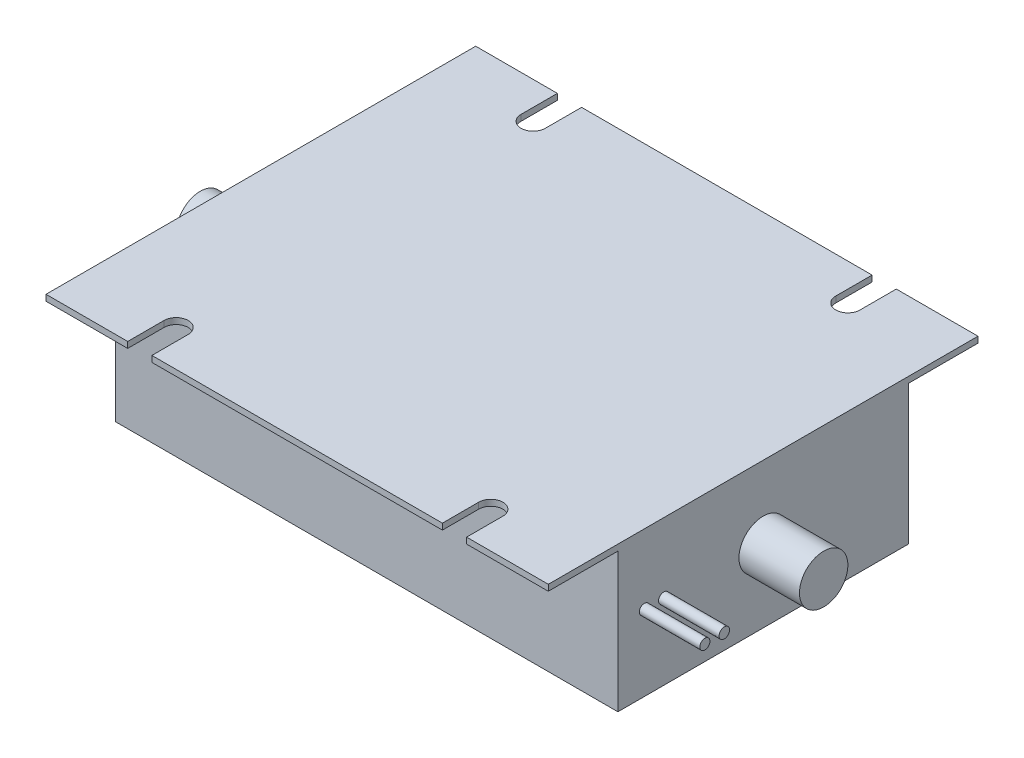
ISO-10303-21;
HEADER;
FILE_DESCRIPTION(('STEP AP214'),'2;1');
FILE_NAME('part.step','',(''),(''),'','','');
FILE_SCHEMA(('AUTOMOTIVE_DESIGN { 1 0 10303 214 1 1 1 1 }'));
ENDSEC;
DATA;
#1=APPLICATION_CONTEXT('core data for automotive mechanical design processes');
#2=APPLICATION_PROTOCOL_DEFINITION('international standard','automotive_design',2000,#1);
#3=PRODUCT_CONTEXT('',#1,'mechanical');
#4=PRODUCT('Part','Part','',(#3));
#5=PRODUCT_RELATED_PRODUCT_CATEGORY('part','',(#4));
#6=PRODUCT_DEFINITION_FORMATION('','',#4);
#7=PRODUCT_DEFINITION_CONTEXT('part definition',#1,'design');
#8=PRODUCT_DEFINITION('design','',#6,#7);
#9=PRODUCT_DEFINITION_SHAPE('','',#8);
#10=(LENGTH_UNIT() NAMED_UNIT(*) SI_UNIT(.MILLI.,.METRE.));
#11=(NAMED_UNIT(*) PLANE_ANGLE_UNIT() SI_UNIT($,.RADIAN.));
#12=(NAMED_UNIT(*) SI_UNIT($,.STERADIAN.) SOLID_ANGLE_UNIT());
#13=UNCERTAINTY_MEASURE_WITH_UNIT(LENGTH_MEASURE(1.E-05),#10,'distance_accuracy_value','');
#14=(GEOMETRIC_REPRESENTATION_CONTEXT(3) GLOBAL_UNCERTAINTY_ASSIGNED_CONTEXT((#13)) GLOBAL_UNIT_ASSIGNED_CONTEXT((#10,
#11,#12)) REPRESENTATION_CONTEXT('',''));
#15=CARTESIAN_POINT('',(0.,0.,0.));
#16=DIRECTION('',(0.,0.,1.));
#17=DIRECTION('',(1.,0.,0.));
#18=AXIS2_PLACEMENT_3D('',#15,#16,#17);
#19=CARTESIAN_POINT('',(0.,0.,35.5));
#20=DIRECTION('',(0.,0.,1.));
#21=DIRECTION('',(1.,0.,0.));
#22=AXIS2_PLACEMENT_3D('',#19,#20,#21);
#23=PLANE('',#22);
#24=DIRECTION('',(-1.,0.,0.));
#25=VECTOR('',#24,1.);
#26=CARTESIAN_POINT('',(-41.5,17.,35.5));
#27=LINE('',#26,#25);
#28=CARTESIAN_POINT('',(24.,17.,35.5));
#29=VERTEX_POINT('',#28);
#30=CARTESIAN_POINT('',(-24.,17.,35.5));
#31=VERTEX_POINT('',#30);
#32=EDGE_CURVE('E304',#29,#31,#27,.T.);
#33=ORIENTED_EDGE('',*,*,#32,.F.);
#34=DIRECTION('',(0.,1.,0.));
#35=VECTOR('',#34,1.);
#36=CARTESIAN_POINT('',(24.,0.,35.5));
#37=LINE('',#36,#35);
#38=CARTESIAN_POINT('',(24.,18.,35.5));
#39=VERTEX_POINT('',#38);
#40=EDGE_CURVE('E373',#29,#39,#37,.T.);
#41=ORIENTED_EDGE('',*,*,#40,.T.);
#42=DIRECTION('',(1.,0.,0.));
#43=VECTOR('',#42,1.);
#44=CARTESIAN_POINT('',(41.5,18.,35.5));
#45=LINE('',#44,#43);
#46=CARTESIAN_POINT('',(-24.,18.,35.5));
#47=VERTEX_POINT('',#46);
#48=EDGE_CURVE('E215',#47,#39,#45,.T.);
#49=ORIENTED_EDGE('',*,*,#48,.F.);
#50=DIRECTION('',(0.,1.,0.));
#51=VECTOR('',#50,1.);
#52=CARTESIAN_POINT('',(-24.,0.,35.5));
#53=LINE('',#52,#51);
#54=EDGE_CURVE('E368',#31,#47,#53,.T.);
#55=ORIENTED_EDGE('',*,*,#54,.F.);
#56=EDGE_LOOP('',(#33,#41,#49,#55));
#57=FACE_BOUND('',#56,.T.);
#58=ADVANCED_FACE('F33',(#57),#23,.T.);
#59=CARTESIAN_POINT('',(-28.,17.,35.5));
#60=VERTEX_POINT('',#59);
#61=CARTESIAN_POINT('',(-41.5,17.,35.5));
#62=VERTEX_POINT('',#61);
#63=EDGE_CURVE('E299',#60,#62,#27,.T.);
#64=ORIENTED_EDGE('',*,*,#63,.F.);
#65=DIRECTION('',(0.,1.,0.));
#66=VECTOR('',#65,1.);
#67=CARTESIAN_POINT('',(-28.,0.,35.5));
#68=LINE('',#67,#66);
#69=CARTESIAN_POINT('',(-28.,18.,35.5));
#70=VERTEX_POINT('',#69);
#71=EDGE_CURVE('E366',#60,#70,#68,.T.);
#72=ORIENTED_EDGE('',*,*,#71,.T.);
#73=CARTESIAN_POINT('',(-41.5,18.,35.5));
#74=VERTEX_POINT('',#73);
#75=EDGE_CURVE('E283',#74,#70,#45,.T.);
#76=ORIENTED_EDGE('',*,*,#75,.F.);
#77=DIRECTION('',(0.,1.,0.));
#78=VECTOR('',#77,1.);
#79=CARTESIAN_POINT('',(-41.5,18.,35.5));
#80=LINE('',#79,#78);
#81=EDGE_CURVE('E303',#62,#74,#80,.T.);
#82=ORIENTED_EDGE('',*,*,#81,.F.);
#83=EDGE_LOOP('',(#64,#72,#76,#82));
#84=FACE_BOUND('',#83,.T.);
#85=ADVANCED_FACE('F448',(#84),#23,.T.);
#86=CARTESIAN_POINT('',(0.,0.,-35.5));
#87=DIRECTION('',(0.,0.,1.));
#88=DIRECTION('',(1.,0.,0.));
#89=AXIS2_PLACEMENT_3D('',#86,#87,#88);
#90=PLANE('',#89);
#91=DIRECTION('',(0.,1.,0.));
#92=VECTOR('',#91,1.);
#93=CARTESIAN_POINT('',(-24.,-6.,-35.5));
#94=LINE('',#93,#92);
#95=CARTESIAN_POINT('',(-24.,17.,-35.5));
#96=VERTEX_POINT('',#95);
#97=CARTESIAN_POINT('',(-24.,18.,-35.5));
#98=VERTEX_POINT('',#97);
#99=EDGE_CURVE('E256',#96,#98,#94,.T.);
#100=ORIENTED_EDGE('',*,*,#99,.T.);
#101=DIRECTION('',(1.,0.,0.));
#102=VECTOR('',#101,1.);
#103=CARTESIAN_POINT('',(41.5,18.,-35.5));
#104=LINE('',#103,#102);
#105=CARTESIAN_POINT('',(24.,18.,-35.5));
#106=VERTEX_POINT('',#105);
#107=EDGE_CURVE('E296',#98,#106,#104,.T.);
#108=ORIENTED_EDGE('',*,*,#107,.T.);
#109=DIRECTION('',(0.,1.,0.));
#110=VECTOR('',#109,1.);
#111=CARTESIAN_POINT('',(24.,-6.,-35.5));
#112=LINE('',#111,#110);
#113=CARTESIAN_POINT('',(24.,17.,-35.5));
#114=VERTEX_POINT('',#113);
#115=EDGE_CURVE('E272',#114,#106,#112,.T.);
#116=ORIENTED_EDGE('',*,*,#115,.F.);
#117=DIRECTION('',(-1.,0.,0.));
#118=VECTOR('',#117,1.);
#119=CARTESIAN_POINT('',(-41.5,17.,-35.5));
#120=LINE('',#119,#118);
#121=EDGE_CURVE('E288',#114,#96,#120,.T.);
#122=ORIENTED_EDGE('',*,*,#121,.T.);
#123=EDGE_LOOP('',(#100,#108,#116,#122));
#124=FACE_BOUND('',#123,.T.);
#125=ADVANCED_FACE('F398',(#124),#90,.F.);
#126=DIRECTION('',(0.,1.,0.));
#127=VECTOR('',#126,1.);
#128=CARTESIAN_POINT('',(28.,-6.,-35.5));
#129=LINE('',#128,#127);
#130=CARTESIAN_POINT('',(28.,17.,-35.5));
#131=VERTEX_POINT('',#130);
#132=CARTESIAN_POINT('',(28.,18.,-35.5));
#133=VERTEX_POINT('',#132);
#134=EDGE_CURVE('E275',#131,#133,#129,.T.);
#135=ORIENTED_EDGE('',*,*,#134,.T.);
#136=CARTESIAN_POINT('',(41.5,18.,-35.5));
#137=VERTEX_POINT('',#136);
#138=EDGE_CURVE('E291',#133,#137,#104,.T.);
#139=ORIENTED_EDGE('',*,*,#138,.T.);
#140=DIRECTION('',(0.,-1.,0.));
#141=VECTOR('',#140,1.);
#142=CARTESIAN_POINT('',(41.5,17.,-35.5));
#143=LINE('',#142,#141);
#144=CARTESIAN_POINT('',(41.5,17.,-35.5));
#145=VERTEX_POINT('',#144);
#146=EDGE_CURVE('E279',#137,#145,#143,.T.);
#147=ORIENTED_EDGE('',*,*,#146,.T.);
#148=EDGE_CURVE('E284',#145,#131,#120,.T.);
#149=ORIENTED_EDGE('',*,*,#148,.T.);
#150=EDGE_LOOP('',(#135,#139,#147,#149));
#151=FACE_BOUND('',#150,.T.);
#152=ADVANCED_FACE('F543',(#151),#90,.F.);
#153=CARTESIAN_POINT('',(-41.5,-6.,24.));
#154=DIRECTION('',(0.,0.,1.));
#155=DIRECTION('',(1.,0.,0.));
#156=AXIS2_PLACEMENT_3D('',#153,#154,#155);
#157=PLANE('',#156);
#158=DIRECTION('',(0.,1.,0.));
#159=VECTOR('',#158,1.);
#160=CARTESIAN_POINT('',(41.5,-6.,24.));
#161=LINE('',#160,#159);
#162=CARTESIAN_POINT('',(41.5,-6.,24.));
#163=VERTEX_POINT('',#162);
#164=CARTESIAN_POINT('',(41.5,17.,24.));
#165=VERTEX_POINT('',#164);
#166=EDGE_CURVE('E336',#163,#165,#161,.T.);
#167=ORIENTED_EDGE('',*,*,#166,.T.);
#168=DIRECTION('',(-1.,0.,0.));
#169=VECTOR('',#168,1.);
#170=CARTESIAN_POINT('',(-41.5,17.,24.));
#171=LINE('',#170,#169);
#172=CARTESIAN_POINT('',(-41.5,17.,24.));
#173=VERTEX_POINT('',#172);
#174=EDGE_CURVE('E319',#165,#173,#171,.T.);
#175=ORIENTED_EDGE('',*,*,#174,.T.);
#176=DIRECTION('',(0.,1.,0.));
#177=VECTOR('',#176,1.);
#178=CARTESIAN_POINT('',(-41.5,-6.,24.));
#179=LINE('',#178,#177);
#180=CARTESIAN_POINT('',(-41.5,-6.,24.));
#181=VERTEX_POINT('',#180);
#182=EDGE_CURVE('E340',#181,#173,#179,.T.);
#183=ORIENTED_EDGE('',*,*,#182,.F.);
#184=DIRECTION('',(1.,0.,0.));
#185=VECTOR('',#184,1.);
#186=CARTESIAN_POINT('',(-41.5,-6.,24.));
#187=LINE('',#186,#185);
#188=EDGE_CURVE('E323',#181,#163,#187,.T.);
#189=ORIENTED_EDGE('',*,*,#188,.T.);
#190=EDGE_LOOP('',(#167,#175,#183,#189));
#191=FACE_BOUND('',#190,.T.);
#192=ADVANCED_FACE('F35',(#191),#157,.T.);
#193=CARTESIAN_POINT('',(41.5,-6.,-24.));
#194=DIRECTION('',(0.,0.,-1.));
#195=DIRECTION('',(-1.,0.,0.));
#196=AXIS2_PLACEMENT_3D('',#193,#194,#195);
#197=PLANE('',#196);
#198=DIRECTION('',(0.,1.,0.));
#199=VECTOR('',#198,1.);
#200=CARTESIAN_POINT('',(-41.5,-6.,-24.));
#201=LINE('',#200,#199);
#202=CARTESIAN_POINT('',(-41.5,-6.,-24.));
#203=VERTEX_POINT('',#202);
#204=CARTESIAN_POINT('',(-41.5,17.,-24.));
#205=VERTEX_POINT('',#204);
#206=EDGE_CURVE('E344',#203,#205,#201,.T.);
#207=ORIENTED_EDGE('',*,*,#206,.T.);
#208=DIRECTION('',(1.,0.,0.));
#209=VECTOR('',#208,1.);
#210=CARTESIAN_POINT('',(41.5,17.,-24.));
#211=LINE('',#210,#209);
#212=CARTESIAN_POINT('',(41.5,17.,-24.));
#213=VERTEX_POINT('',#212);
#214=EDGE_CURVE('E316',#205,#213,#211,.T.);
#215=ORIENTED_EDGE('',*,*,#214,.T.);
#216=DIRECTION('',(0.,1.,0.));
#217=VECTOR('',#216,1.);
#218=CARTESIAN_POINT('',(41.5,-6.,-24.));
#219=LINE('',#218,#217);
#220=CARTESIAN_POINT('',(41.5,-6.,-24.));
#221=VERTEX_POINT('',#220);
#222=EDGE_CURVE('E347',#221,#213,#219,.T.);
#223=ORIENTED_EDGE('',*,*,#222,.F.);
#224=DIRECTION('',(-1.,0.,0.));
#225=VECTOR('',#224,1.);
#226=CARTESIAN_POINT('',(41.5,-6.,-24.));
#227=LINE('',#226,#225);
#228=EDGE_CURVE('E330',#221,#203,#227,.T.);
#229=ORIENTED_EDGE('',*,*,#228,.T.);
#230=EDGE_LOOP('',(#207,#215,#223,#229));
#231=FACE_BOUND('',#230,.T.);
#232=ADVANCED_FACE('F476',(#231),#197,.T.);
#233=CARTESIAN_POINT('',(-41.5,-6.,-24.));
#234=DIRECTION('',(-1.,0.,0.));
#235=DIRECTION('',(0.,0.,1.));
#236=AXIS2_PLACEMENT_3D('',#233,#234,#235);
#237=PLANE('',#236);
#238=CARTESIAN_POINT('',(-41.5,6.,0.));
#239=DIRECTION('',(-1.,0.,0.));
#240=DIRECTION('',(0.,0.,1.));
#241=AXIS2_PLACEMENT_3D('',#238,#239,#240);
#242=CIRCLE('',#241,4.);
#243=CARTESIAN_POINT('',(-41.5,6.,4.00000000000001));
#244=VERTEX_POINT('',#243);
#245=EDGE_CURVE('E716',#244,#244,#242,.T.);
#246=ORIENTED_EDGE('',*,*,#245,.F.);
#247=EDGE_LOOP('',(#246));
#248=FACE_BOUND('',#247,.T.);
#249=DIRECTION('',(0.,0.,1.));
#250=VECTOR('',#249,1.);
#251=CARTESIAN_POINT('',(-41.5,17.,-35.5));
#252=LINE('',#251,#250);
#253=CARTESIAN_POINT('',(-41.5,17.,-35.5));
#254=VERTEX_POINT('',#253);
#255=EDGE_CURVE('E310',#254,#205,#252,.T.);
#256=ORIENTED_EDGE('',*,*,#255,.T.);
#257=ORIENTED_EDGE('',*,*,#206,.F.);
#258=DIRECTION('',(0.,0.,1.));
#259=VECTOR('',#258,1.);
#260=CARTESIAN_POINT('',(-41.5,-6.,-24.));
#261=LINE('',#260,#259);
#262=EDGE_CURVE('E333',#203,#181,#261,.T.);
#263=ORIENTED_EDGE('',*,*,#262,.T.);
#264=ORIENTED_EDGE('',*,*,#182,.T.);
#265=EDGE_CURVE('E295',#173,#62,#252,.T.);
#266=ORIENTED_EDGE('',*,*,#265,.T.);
#267=ORIENTED_EDGE('',*,*,#81,.T.);
#268=DIRECTION('',(0.,0.,1.));
#269=VECTOR('',#268,1.);
#270=CARTESIAN_POINT('',(-41.5,18.,-24.));
#271=LINE('',#270,#269);
#272=CARTESIAN_POINT('',(-41.5,18.,-35.5));
#273=VERTEX_POINT('',#272);
#274=EDGE_CURVE('E327',#273,#74,#271,.T.);
#275=ORIENTED_EDGE('',*,*,#274,.F.);
#276=DIRECTION('',(0.,1.,0.));
#277=VECTOR('',#276,1.);
#278=CARTESIAN_POINT('',(-41.5,18.,-35.5));
#279=LINE('',#278,#277);
#280=EDGE_CURVE('E287',#254,#273,#279,.T.);
#281=ORIENTED_EDGE('',*,*,#280,.F.);
#282=EDGE_LOOP('',(#256,#257,#263,#264,#266,#267,#275,#281));
#283=FACE_BOUND('',#282,.T.);
#284=ADVANCED_FACE('F421',(#248,#283),#237,.T.);
#285=CARTESIAN_POINT('',(41.5,-6.,24.));
#286=DIRECTION('',(1.,0.,0.));
#287=DIRECTION('',(0.,0.,-1.));
#288=AXIS2_PLACEMENT_3D('',#285,#286,#287);
#289=PLANE('',#288);
#290=CARTESIAN_POINT('',(41.5,6.49948181283472,16.419283225137));
#291=DIRECTION('',(1.,0.,0.));
#292=DIRECTION('',(0.,0.,-1.));
#293=AXIS2_PLACEMENT_3D('',#290,#291,#292);
#294=CIRCLE('',#293,0.866649433394376);
#295=CARTESIAN_POINT('',(41.5,6.49948181283472,15.5526337917427));
#296=VERTEX_POINT('',#295);
#297=EDGE_CURVE('E489',#296,#296,#294,.T.);
#298=ORIENTED_EDGE('',*,*,#297,.F.);
#299=EDGE_LOOP('',(#298));
#300=FACE_BOUND('',#299,.T.);
#301=CARTESIAN_POINT('',(41.5,6.49948181283472,19.6285527423375));
#302=DIRECTION('',(1.,0.,0.));
#303=DIRECTION('',(0.,0.,-1.));
#304=AXIS2_PLACEMENT_3D('',#301,#302,#303);
#305=CIRCLE('',#304,0.835314328900505);
#306=CARTESIAN_POINT('',(41.5,6.49948181283472,18.793238413437));
#307=VERTEX_POINT('',#306);
#308=EDGE_CURVE('E493',#307,#307,#305,.T.);
#309=ORIENTED_EDGE('',*,*,#308,.F.);
#310=EDGE_LOOP('',(#309));
#311=FACE_BOUND('',#310,.T.);
#312=CARTESIAN_POINT('',(41.5,6.,0.));
#313=DIRECTION('',(1.,0.,0.));
#314=DIRECTION('',(0.,0.,-1.));
#315=AXIS2_PLACEMENT_3D('',#312,#313,#314);
#316=CIRCLE('',#315,4.);
#317=CARTESIAN_POINT('',(41.5,6.,-3.99999999999999));
#318=VERTEX_POINT('',#317);
#319=EDGE_CURVE('E11',#318,#318,#316,.T.);
#320=ORIENTED_EDGE('',*,*,#319,.F.);
#321=EDGE_LOOP('',(#320));
#322=FACE_BOUND('',#321,.T.);
#323=DIRECTION('',(0.,0.,-1.));
#324=VECTOR('',#323,1.);
#325=CARTESIAN_POINT('',(41.5,18.,24.));
#326=LINE('',#325,#324);
#327=CARTESIAN_POINT('',(41.5,18.,35.5));
#328=VERTEX_POINT('',#327);
#329=EDGE_CURVE('E322',#328,#137,#326,.T.);
#330=ORIENTED_EDGE('',*,*,#329,.F.);
#331=DIRECTION('',(0.,-1.,0.));
#332=VECTOR('',#331,1.);
#333=CARTESIAN_POINT('',(41.5,17.,35.5));
#334=LINE('',#333,#332);
#335=CARTESIAN_POINT('',(41.5,17.,35.5));
#336=VERTEX_POINT('',#335);
#337=EDGE_CURVE('E271',#328,#336,#334,.T.);
#338=ORIENTED_EDGE('',*,*,#337,.T.);
#339=DIRECTION('',(0.,0.,1.));
#340=VECTOR('',#339,1.);
#341=CARTESIAN_POINT('',(41.5,17.,-35.5));
#342=LINE('',#341,#340);
#343=EDGE_CURVE('E313',#165,#336,#342,.T.);
#344=ORIENTED_EDGE('',*,*,#343,.F.);
#345=ORIENTED_EDGE('',*,*,#166,.F.);
#346=DIRECTION('',(0.,0.,-1.));
#347=VECTOR('',#346,1.);
#348=CARTESIAN_POINT('',(41.5,-6.,24.));
#349=LINE('',#348,#347);
#350=EDGE_CURVE('E326',#163,#221,#349,.T.);
#351=ORIENTED_EDGE('',*,*,#350,.T.);
#352=ORIENTED_EDGE('',*,*,#222,.T.);
#353=EDGE_CURVE('E314',#145,#213,#342,.T.);
#354=ORIENTED_EDGE('',*,*,#353,.F.);
#355=ORIENTED_EDGE('',*,*,#146,.F.);
#356=EDGE_LOOP('',(#330,#338,#344,#345,#351,#352,#354,#355));
#357=FACE_BOUND('',#356,.T.);
#358=ADVANCED_FACE('F389',(#300,#311,#322,#357),#289,.T.);
#359=CARTESIAN_POINT('',(0.,-6.,0.));
#360=DIRECTION('',(0.,1.,0.));
#361=DIRECTION('',(0.,0.,1.));
#362=AXIS2_PLACEMENT_3D('',#359,#360,#361);
#363=PLANE('',#362);
#364=ORIENTED_EDGE('',*,*,#188,.F.);
#365=ORIENTED_EDGE('',*,*,#262,.F.);
#366=ORIENTED_EDGE('',*,*,#228,.F.);
#367=ORIENTED_EDGE('',*,*,#350,.F.);
#368=EDGE_LOOP('',(#364,#365,#366,#367));
#369=FACE_BOUND('',#368,.T.);
#370=ADVANCED_FACE('F468',(#369),#363,.F.);
#371=CARTESIAN_POINT('',(0.,18.,0.));
#372=DIRECTION('',(0.,1.,0.));
#373=DIRECTION('',(0.,0.,1.));
#374=AXIS2_PLACEMENT_3D('',#371,#372,#373);
#375=PLANE('',#374);
#376=DIRECTION('',(0.,0.,-1.));
#377=VECTOR('',#376,1.);
#378=CARTESIAN_POINT('',(28.,18.,0.));
#379=LINE('',#378,#377);
#380=CARTESIAN_POINT('',(28.,18.,35.5));
#381=VERTEX_POINT('',#380);
#382=CARTESIAN_POINT('',(28.,18.,29.5));
#383=VERTEX_POINT('',#382);
#384=EDGE_CURVE('E200',#381,#383,#379,.T.);
#385=ORIENTED_EDGE('',*,*,#384,.F.);
#386=EDGE_CURVE('E307',#381,#328,#45,.T.);
#387=ORIENTED_EDGE('',*,*,#386,.T.);
#388=ORIENTED_EDGE('',*,*,#329,.T.);
#389=ORIENTED_EDGE('',*,*,#138,.F.);
#390=DIRECTION('',(0.,0.,1.));
#391=VECTOR('',#390,1.);
#392=CARTESIAN_POINT('',(28.,18.,0.));
#393=LINE('',#392,#391);
#394=CARTESIAN_POINT('',(28.,18.,-29.5));
#395=VERTEX_POINT('',#394);
#396=EDGE_CURVE('E262',#133,#395,#393,.T.);
#397=ORIENTED_EDGE('',*,*,#396,.T.);
#398=CARTESIAN_POINT('',(26.,18.,-29.5));
#399=DIRECTION('',(0.,1.,0.));
#400=DIRECTION('',(0.,0.,1.));
#401=AXIS2_PLACEMENT_3D('',#398,#399,#400);
#402=CIRCLE('',#401,2.);
#403=CARTESIAN_POINT('',(24.,18.,-29.5));
#404=VERTEX_POINT('',#403);
#405=EDGE_CURVE('E253',#404,#395,#402,.T.);
#406=ORIENTED_EDGE('',*,*,#405,.F.);
#407=DIRECTION('',(0.,0.,1.));
#408=VECTOR('',#407,1.);
#409=CARTESIAN_POINT('',(24.,18.,0.));
#410=LINE('',#409,#408);
#411=EDGE_CURVE('E265',#106,#404,#410,.T.);
#412=ORIENTED_EDGE('',*,*,#411,.F.);
#413=ORIENTED_EDGE('',*,*,#107,.F.);
#414=DIRECTION('',(0.,0.,1.));
#415=VECTOR('',#414,1.);
#416=CARTESIAN_POINT('',(-24.,18.,0.));
#417=LINE('',#416,#415);
#418=CARTESIAN_POINT('',(-24.,18.,-29.5));
#419=VERTEX_POINT('',#418);
#420=EDGE_CURVE('E244',#98,#419,#417,.T.);
#421=ORIENTED_EDGE('',*,*,#420,.T.);
#422=CARTESIAN_POINT('',(-26.,18.,-29.5));
#423=DIRECTION('',(0.,-1.,0.));
#424=DIRECTION('',(0.,0.,1.));
#425=AXIS2_PLACEMENT_3D('',#422,#423,#424);
#426=CIRCLE('',#425,2.);
#427=CARTESIAN_POINT('',(-28.,18.,-29.5));
#428=VERTEX_POINT('',#427);
#429=EDGE_CURVE('E241',#419,#428,#426,.T.);
#430=ORIENTED_EDGE('',*,*,#429,.T.);
#431=DIRECTION('',(0.,0.,1.));
#432=VECTOR('',#431,1.);
#433=CARTESIAN_POINT('',(-28.,18.,0.));
#434=LINE('',#433,#432);
#435=CARTESIAN_POINT('',(-28.,18.,-35.5));
#436=VERTEX_POINT('',#435);
#437=EDGE_CURVE('E247',#436,#428,#434,.T.);
#438=ORIENTED_EDGE('',*,*,#437,.F.);
#439=EDGE_CURVE('E292',#273,#436,#104,.T.);
#440=ORIENTED_EDGE('',*,*,#439,.F.);
#441=ORIENTED_EDGE('',*,*,#274,.T.);
#442=ORIENTED_EDGE('',*,*,#75,.T.);
#443=DIRECTION('',(0.,0.,-1.));
#444=VECTOR('',#443,1.);
#445=CARTESIAN_POINT('',(-28.,18.,0.));
#446=LINE('',#445,#444);
#447=CARTESIAN_POINT('',(-28.,18.,29.5));
#448=VERTEX_POINT('',#447);
#449=EDGE_CURVE('E56',#70,#448,#446,.T.);
#450=ORIENTED_EDGE('',*,*,#449,.T.);
#451=CARTESIAN_POINT('',(-26.,18.,29.5));
#452=DIRECTION('',(0.,1.,0.));
#453=DIRECTION('',(0.,0.,-1.));
#454=AXIS2_PLACEMENT_3D('',#451,#452,#453);
#455=CIRCLE('',#454,2.);
#456=CARTESIAN_POINT('',(-24.,18.,29.5));
#457=VERTEX_POINT('',#456);
#458=EDGE_CURVE('E225',#457,#448,#455,.T.);
#459=ORIENTED_EDGE('',*,*,#458,.F.);
#460=DIRECTION('',(0.,0.,-1.));
#461=VECTOR('',#460,1.);
#462=CARTESIAN_POINT('',(-24.,18.,0.));
#463=LINE('',#462,#461);
#464=EDGE_CURVE('E229',#47,#457,#463,.T.);
#465=ORIENTED_EDGE('',*,*,#464,.F.);
#466=ORIENTED_EDGE('',*,*,#48,.T.);
#467=DIRECTION('',(0.,0.,-1.));
#468=VECTOR('',#467,1.);
#469=CARTESIAN_POINT('',(24.,18.,0.));
#470=LINE('',#469,#468);
#471=CARTESIAN_POINT('',(24.,18.,29.5));
#472=VERTEX_POINT('',#471);
#473=EDGE_CURVE('E48',#39,#472,#470,.T.);
#474=ORIENTED_EDGE('',*,*,#473,.T.);
#475=CARTESIAN_POINT('',(26.,18.,29.5));
#476=DIRECTION('',(0.,-1.,0.));
#477=DIRECTION('',(0.,0.,-1.));
#478=AXIS2_PLACEMENT_3D('',#475,#476,#477);
#479=CIRCLE('',#478,2.);
#480=EDGE_CURVE('E203',#472,#383,#479,.T.);
#481=ORIENTED_EDGE('',*,*,#480,.T.);
#482=EDGE_LOOP('',(#385,#387,#388,#389,#397,#406,#412,#413,#421,#430,#438,#440,#441,#442,#450,
#459,#465,#466,#474,#481));
#483=FACE_BOUND('',#482,.T.);
#484=ADVANCED_FACE('F212',(#483),#375,.T.);
#485=ORIENTED_EDGE('',*,*,#439,.T.);
#486=DIRECTION('',(0.,1.,0.));
#487=VECTOR('',#486,1.);
#488=CARTESIAN_POINT('',(-28.,-6.,-35.5));
#489=LINE('',#488,#487);
#490=CARTESIAN_POINT('',(-28.,17.,-35.5));
#491=VERTEX_POINT('',#490);
#492=EDGE_CURVE('E254',#491,#436,#489,.T.);
#493=ORIENTED_EDGE('',*,*,#492,.F.);
#494=EDGE_CURVE('E282',#491,#254,#120,.T.);
#495=ORIENTED_EDGE('',*,*,#494,.T.);
#496=ORIENTED_EDGE('',*,*,#280,.T.);
#497=EDGE_LOOP('',(#485,#493,#495,#496));
#498=FACE_BOUND('',#497,.T.);
#499=ADVANCED_FACE('F417',(#498),#90,.F.);
#500=CARTESIAN_POINT('',(-41.5,17.,-35.5));
#501=DIRECTION('',(0.,1.,0.));
#502=DIRECTION('',(-1.,0.,0.));
#503=AXIS2_PLACEMENT_3D('',#500,#501,#502);
#504=PLANE('',#503);
#505=ORIENTED_EDGE('',*,*,#494,.F.);
#506=DIRECTION('',(0.,0.,1.));
#507=VECTOR('',#506,1.);
#508=CARTESIAN_POINT('',(-28.,17.,-35.5));
#509=LINE('',#508,#507);
#510=CARTESIAN_POINT('',(-28.,17.,-29.5));
#511=VERTEX_POINT('',#510);
#512=EDGE_CURVE('E363',#491,#511,#509,.T.);
#513=ORIENTED_EDGE('',*,*,#512,.T.);
#514=CARTESIAN_POINT('',(-26.,17.,-29.5));
#515=DIRECTION('',(0.,1.,0.));
#516=DIRECTION('',(-1.,0.,0.));
#517=AXIS2_PLACEMENT_3D('',#514,#515,#516);
#518=CIRCLE('',#517,2.);
#519=CARTESIAN_POINT('',(-24.,17.,-29.5));
#520=VERTEX_POINT('',#519);
#521=EDGE_CURVE('E361',#520,#511,#518,.F.);
#522=ORIENTED_EDGE('',*,*,#521,.F.);
#523=DIRECTION('',(0.,0.,1.));
#524=VECTOR('',#523,1.);
#525=CARTESIAN_POINT('',(-24.,17.,-35.5));
#526=LINE('',#525,#524);
#527=EDGE_CURVE('E359',#96,#520,#526,.T.);
#528=ORIENTED_EDGE('',*,*,#527,.F.);
#529=ORIENTED_EDGE('',*,*,#121,.F.);
#530=DIRECTION('',(0.,0.,1.));
#531=VECTOR('',#530,1.);
#532=CARTESIAN_POINT('',(24.,17.,-35.5));
#533=LINE('',#532,#531);
#534=CARTESIAN_POINT('',(24.,17.,-29.5));
#535=VERTEX_POINT('',#534);
#536=EDGE_CURVE('E356',#114,#535,#533,.T.);
#537=ORIENTED_EDGE('',*,*,#536,.T.);
#538=CARTESIAN_POINT('',(26.,17.,-29.5));
#539=DIRECTION('',(0.,1.,0.));
#540=DIRECTION('',(-1.,0.,0.));
#541=AXIS2_PLACEMENT_3D('',#538,#539,#540);
#542=CIRCLE('',#541,2.);
#543=CARTESIAN_POINT('',(28.,17.,-29.5));
#544=VERTEX_POINT('',#543);
#545=EDGE_CURVE('E353',#535,#544,#542,.T.);
#546=ORIENTED_EDGE('',*,*,#545,.T.);
#547=DIRECTION('',(0.,0.,1.));
#548=VECTOR('',#547,1.);
#549=CARTESIAN_POINT('',(28.,17.,-35.5));
#550=LINE('',#549,#548);
#551=EDGE_CURVE('E343',#131,#544,#550,.T.);
#552=ORIENTED_EDGE('',*,*,#551,.F.);
#553=ORIENTED_EDGE('',*,*,#148,.F.);
#554=ORIENTED_EDGE('',*,*,#353,.T.);
#555=ORIENTED_EDGE('',*,*,#214,.F.);
#556=ORIENTED_EDGE('',*,*,#255,.F.);
#557=EDGE_LOOP('',(#505,#513,#522,#528,#529,#537,#546,#552,#553,#554,#555,#556));
#558=FACE_BOUND('',#557,.T.);
#559=ADVANCED_FACE('F410',(#558),#504,.F.);
#560=CARTESIAN_POINT('',(28.,17.,35.5));
#561=VERTEX_POINT('',#560);
#562=EDGE_CURVE('E300',#336,#561,#27,.T.);
#563=ORIENTED_EDGE('',*,*,#562,.T.);
#564=DIRECTION('',(0.,0.,-1.));
#565=VECTOR('',#564,1.);
#566=CARTESIAN_POINT('',(28.,17.,-35.5));
#567=LINE('',#566,#565);
#568=CARTESIAN_POINT('',(28.,17.,29.5));
#569=VERTEX_POINT('',#568);
#570=EDGE_CURVE('E222',#561,#569,#567,.T.);
#571=ORIENTED_EDGE('',*,*,#570,.T.);
#572=CARTESIAN_POINT('',(26.,17.,29.5));
#573=DIRECTION('',(0.,1.,0.));
#574=DIRECTION('',(-1.,0.,0.));
#575=AXIS2_PLACEMENT_3D('',#572,#573,#574);
#576=CIRCLE('',#575,2.);
#577=CARTESIAN_POINT('',(24.,17.,29.5));
#578=VERTEX_POINT('',#577);
#579=EDGE_CURVE('E41',#578,#569,#576,.F.);
#580=ORIENTED_EDGE('',*,*,#579,.F.);
#581=DIRECTION('',(0.,0.,-1.));
#582=VECTOR('',#581,1.);
#583=CARTESIAN_POINT('',(24.,17.,-35.5));
#584=LINE('',#583,#582);
#585=EDGE_CURVE('E196',#29,#578,#584,.T.);
#586=ORIENTED_EDGE('',*,*,#585,.F.);
#587=ORIENTED_EDGE('',*,*,#32,.T.);
#588=DIRECTION('',(0.,0.,-1.));
#589=VECTOR('',#588,1.);
#590=CARTESIAN_POINT('',(-24.,17.,-35.5));
#591=LINE('',#590,#589);
#592=CARTESIAN_POINT('',(-24.,17.,29.5));
#593=VERTEX_POINT('',#592);
#594=EDGE_CURVE('E238',#31,#593,#591,.T.);
#595=ORIENTED_EDGE('',*,*,#594,.T.);
#596=CARTESIAN_POINT('',(-26.,17.,29.5));
#597=DIRECTION('',(0.,1.,0.));
#598=DIRECTION('',(-1.,0.,0.));
#599=AXIS2_PLACEMENT_3D('',#596,#597,#598);
#600=CIRCLE('',#599,2.);
#601=CARTESIAN_POINT('',(-28.,17.,29.5));
#602=VERTEX_POINT('',#601);
#603=EDGE_CURVE('E370',#593,#602,#600,.T.);
#604=ORIENTED_EDGE('',*,*,#603,.T.);
#605=DIRECTION('',(0.,0.,-1.));
#606=VECTOR('',#605,1.);
#607=CARTESIAN_POINT('',(-28.,17.,-35.5));
#608=LINE('',#607,#606);
#609=EDGE_CURVE('E235',#60,#602,#608,.T.);
#610=ORIENTED_EDGE('',*,*,#609,.F.);
#611=ORIENTED_EDGE('',*,*,#63,.T.);
#612=ORIENTED_EDGE('',*,*,#265,.F.);
#613=ORIENTED_EDGE('',*,*,#174,.F.);
#614=ORIENTED_EDGE('',*,*,#343,.T.);
#615=EDGE_LOOP('',(#563,#571,#580,#586,#587,#595,#604,#610,#611,#612,#613,#614));
#616=FACE_BOUND('',#615,.T.);
#617=ADVANCED_FACE('F380',(#616),#504,.F.);
#618=DIRECTION('',(0.,1.,0.));
#619=VECTOR('',#618,1.);
#620=CARTESIAN_POINT('',(28.,0.,35.5));
#621=LINE('',#620,#619);
#622=EDGE_CURVE('E375',#561,#381,#621,.T.);
#623=ORIENTED_EDGE('',*,*,#622,.F.);
#624=ORIENTED_EDGE('',*,*,#562,.F.);
#625=ORIENTED_EDGE('',*,*,#337,.F.);
#626=ORIENTED_EDGE('',*,*,#386,.F.);
#627=EDGE_LOOP('',(#623,#624,#625,#626));
#628=FACE_BOUND('',#627,.T.);
#629=ADVANCED_FACE('F385',(#628),#23,.T.);
#630=CARTESIAN_POINT('',(26.,-6.,-29.5));
#631=DIRECTION('',(0.,1.,0.));
#632=DIRECTION('',(0.,0.,1.));
#633=AXIS2_PLACEMENT_3D('',#630,#631,#632);
#634=CYLINDRICAL_SURFACE('',#633,2.);
#635=DIRECTION('',(0.,1.,0.));
#636=VECTOR('',#635,1.);
#637=CARTESIAN_POINT('',(24.,-6.,-29.5));
#638=LINE('',#637,#636);
#639=EDGE_CURVE('E269',#535,#404,#638,.T.);
#640=ORIENTED_EDGE('',*,*,#639,.T.);
#641=ORIENTED_EDGE('',*,*,#405,.T.);
#642=DIRECTION('',(0.,1.,0.));
#643=VECTOR('',#642,1.);
#644=CARTESIAN_POINT('',(28.,-6.,-29.5));
#645=LINE('',#644,#643);
#646=EDGE_CURVE('E268',#544,#395,#645,.T.);
#647=ORIENTED_EDGE('',*,*,#646,.F.);
#648=ORIENTED_EDGE('',*,*,#545,.F.);
#649=EDGE_LOOP('',(#640,#641,#647,#648));
#650=FACE_BOUND('',#649,.T.);
#651=ADVANCED_FACE('F407',(#650),#634,.F.);
#652=CARTESIAN_POINT('',(24.,-6.,0.));
#653=DIRECTION('',(-1.,0.,0.));
#654=DIRECTION('',(0.,0.,1.));
#655=AXIS2_PLACEMENT_3D('',#652,#653,#654);
#656=PLANE('',#655);
#657=ORIENTED_EDGE('',*,*,#115,.T.);
#658=ORIENTED_EDGE('',*,*,#411,.T.);
#659=ORIENTED_EDGE('',*,*,#639,.F.);
#660=ORIENTED_EDGE('',*,*,#536,.F.);
#661=EDGE_LOOP('',(#657,#658,#659,#660));
#662=FACE_BOUND('',#661,.T.);
#663=ADVANCED_FACE('F403',(#662),#656,.F.);
#664=CARTESIAN_POINT('',(28.,-6.,0.));
#665=DIRECTION('',(-1.,0.,0.));
#666=DIRECTION('',(0.,0.,1.));
#667=AXIS2_PLACEMENT_3D('',#664,#665,#666);
#668=PLANE('',#667);
#669=ORIENTED_EDGE('',*,*,#551,.T.);
#670=ORIENTED_EDGE('',*,*,#646,.T.);
#671=ORIENTED_EDGE('',*,*,#396,.F.);
#672=ORIENTED_EDGE('',*,*,#134,.F.);
#673=EDGE_LOOP('',(#669,#670,#671,#672));
#674=FACE_BOUND('',#673,.T.);
#675=ADVANCED_FACE('F569',(#674),#668,.T.);
#676=CARTESIAN_POINT('',(-26.,-6.,-29.5));
#677=DIRECTION('',(0.,1.,0.));
#678=DIRECTION('',(0.,0.,1.));
#679=AXIS2_PLACEMENT_3D('',#676,#677,#678);
#680=CYLINDRICAL_SURFACE('',#679,2.);
#681=ORIENTED_EDGE('',*,*,#521,.T.);
#682=DIRECTION('',(0.,1.,0.));
#683=VECTOR('',#682,1.);
#684=CARTESIAN_POINT('',(-28.,-6.,-29.5));
#685=LINE('',#684,#683);
#686=EDGE_CURVE('E251',#511,#428,#685,.T.);
#687=ORIENTED_EDGE('',*,*,#686,.T.);
#688=ORIENTED_EDGE('',*,*,#429,.F.);
#689=DIRECTION('',(0.,1.,0.));
#690=VECTOR('',#689,1.);
#691=CARTESIAN_POINT('',(-24.,-6.,-29.5));
#692=LINE('',#691,#690);
#693=EDGE_CURVE('E250',#520,#419,#692,.T.);
#694=ORIENTED_EDGE('',*,*,#693,.F.);
#695=EDGE_LOOP('',(#681,#687,#688,#694));
#696=FACE_BOUND('',#695,.T.);
#697=ADVANCED_FACE('F432',(#696),#680,.F.);
#698=CARTESIAN_POINT('',(-28.,-6.,0.));
#699=DIRECTION('',(-1.,0.,0.));
#700=DIRECTION('',(0.,0.,1.));
#701=AXIS2_PLACEMENT_3D('',#698,#699,#700);
#702=PLANE('',#701);
#703=ORIENTED_EDGE('',*,*,#492,.T.);
#704=ORIENTED_EDGE('',*,*,#437,.T.);
#705=ORIENTED_EDGE('',*,*,#686,.F.);
#706=ORIENTED_EDGE('',*,*,#512,.F.);
#707=EDGE_LOOP('',(#703,#704,#705,#706));
#708=FACE_BOUND('',#707,.T.);
#709=ADVANCED_FACE('F429',(#708),#702,.F.);
#710=CARTESIAN_POINT('',(-24.,-6.,0.));
#711=DIRECTION('',(-1.,0.,0.));
#712=DIRECTION('',(0.,0.,1.));
#713=AXIS2_PLACEMENT_3D('',#710,#711,#712);
#714=PLANE('',#713);
#715=ORIENTED_EDGE('',*,*,#527,.T.);
#716=ORIENTED_EDGE('',*,*,#693,.T.);
#717=ORIENTED_EDGE('',*,*,#420,.F.);
#718=ORIENTED_EDGE('',*,*,#99,.F.);
#719=EDGE_LOOP('',(#715,#716,#717,#718));
#720=FACE_BOUND('',#719,.T.);
#721=ADVANCED_FACE('F434',(#720),#714,.T.);
#722=CARTESIAN_POINT('',(-26.,-6.,29.5));
#723=DIRECTION('',(0.,1.,0.));
#724=DIRECTION('',(0.,0.,1.));
#725=AXIS2_PLACEMENT_3D('',#722,#723,#724);
#726=CYLINDRICAL_SURFACE('',#725,2.);
#727=DIRECTION('',(0.,1.,0.));
#728=VECTOR('',#727,1.);
#729=CARTESIAN_POINT('',(-24.,-6.,29.5));
#730=LINE('',#729,#728);
#731=EDGE_CURVE('E233',#593,#457,#730,.T.);
#732=ORIENTED_EDGE('',*,*,#731,.T.);
#733=ORIENTED_EDGE('',*,*,#458,.T.);
#734=DIRECTION('',(0.,1.,0.));
#735=VECTOR('',#734,1.);
#736=CARTESIAN_POINT('',(-28.,-6.,29.5));
#737=LINE('',#736,#735);
#738=EDGE_CURVE('E232',#602,#448,#737,.T.);
#739=ORIENTED_EDGE('',*,*,#738,.F.);
#740=ORIENTED_EDGE('',*,*,#603,.F.);
#741=EDGE_LOOP('',(#732,#733,#739,#740));
#742=FACE_BOUND('',#741,.T.);
#743=ADVANCED_FACE('F436',(#742),#726,.F.);
#744=CARTESIAN_POINT('',(-24.,-6.,0.));
#745=DIRECTION('',(1.,0.,0.));
#746=DIRECTION('',(0.,0.,-1.));
#747=AXIS2_PLACEMENT_3D('',#744,#745,#746);
#748=PLANE('',#747);
#749=ORIENTED_EDGE('',*,*,#54,.T.);
#750=ORIENTED_EDGE('',*,*,#464,.T.);
#751=ORIENTED_EDGE('',*,*,#731,.F.);
#752=ORIENTED_EDGE('',*,*,#594,.F.);
#753=EDGE_LOOP('',(#749,#750,#751,#752));
#754=FACE_BOUND('',#753,.T.);
#755=ADVANCED_FACE('F442',(#754),#748,.F.);
#756=CARTESIAN_POINT('',(-28.,-6.,0.));
#757=DIRECTION('',(1.,0.,0.));
#758=DIRECTION('',(0.,0.,-1.));
#759=AXIS2_PLACEMENT_3D('',#756,#757,#758);
#760=PLANE('',#759);
#761=ORIENTED_EDGE('',*,*,#609,.T.);
#762=ORIENTED_EDGE('',*,*,#738,.T.);
#763=ORIENTED_EDGE('',*,*,#449,.F.);
#764=ORIENTED_EDGE('',*,*,#71,.F.);
#765=EDGE_LOOP('',(#761,#762,#763,#764));
#766=FACE_BOUND('',#765,.T.);
#767=ADVANCED_FACE('F524',(#766),#760,.T.);
#768=CARTESIAN_POINT('',(26.,-6.,29.5));
#769=DIRECTION('',(0.,1.,0.));
#770=DIRECTION('',(0.,0.,1.));
#771=AXIS2_PLACEMENT_3D('',#768,#769,#770);
#772=CYLINDRICAL_SURFACE('',#771,2.);
#773=ORIENTED_EDGE('',*,*,#579,.T.);
#774=DIRECTION('',(0.,1.,0.));
#775=VECTOR('',#774,1.);
#776=CARTESIAN_POINT('',(28.,-6.,29.5));
#777=LINE('',#776,#775);
#778=EDGE_CURVE('E199',#569,#383,#777,.T.);
#779=ORIENTED_EDGE('',*,*,#778,.T.);
#780=ORIENTED_EDGE('',*,*,#480,.F.);
#781=DIRECTION('',(0.,1.,0.));
#782=VECTOR('',#781,1.);
#783=CARTESIAN_POINT('',(24.,-6.,29.5));
#784=LINE('',#783,#782);
#785=EDGE_CURVE('E192',#578,#472,#784,.T.);
#786=ORIENTED_EDGE('',*,*,#785,.F.);
#787=EDGE_LOOP('',(#773,#779,#780,#786));
#788=FACE_BOUND('',#787,.T.);
#789=ADVANCED_FACE('F204',(#788),#772,.F.);
#790=CARTESIAN_POINT('',(28.,-6.,0.));
#791=DIRECTION('',(1.,0.,0.));
#792=DIRECTION('',(0.,0.,-1.));
#793=AXIS2_PLACEMENT_3D('',#790,#791,#792);
#794=PLANE('',#793);
#795=ORIENTED_EDGE('',*,*,#622,.T.);
#796=ORIENTED_EDGE('',*,*,#384,.T.);
#797=ORIENTED_EDGE('',*,*,#778,.F.);
#798=ORIENTED_EDGE('',*,*,#570,.F.);
#799=EDGE_LOOP('',(#795,#796,#797,#798));
#800=FACE_BOUND('',#799,.T.);
#801=ADVANCED_FACE('F378',(#800),#794,.F.);
#802=CARTESIAN_POINT('',(24.,-6.,0.));
#803=DIRECTION('',(1.,0.,0.));
#804=DIRECTION('',(0.,0.,-1.));
#805=AXIS2_PLACEMENT_3D('',#802,#803,#804);
#806=PLANE('',#805);
#807=ORIENTED_EDGE('',*,*,#585,.T.);
#808=ORIENTED_EDGE('',*,*,#785,.T.);
#809=ORIENTED_EDGE('',*,*,#473,.F.);
#810=ORIENTED_EDGE('',*,*,#40,.F.);
#811=EDGE_LOOP('',(#807,#808,#809,#810));
#812=FACE_BOUND('',#811,.T.);
#813=ADVANCED_FACE('F194',(#812),#806,.T.);
#814=CARTESIAN_POINT('',(-51.5,6.,0.));
#815=DIRECTION('',(1.,0.,0.));
#816=DIRECTION('',(0.,0.,-1.));
#817=AXIS2_PLACEMENT_3D('',#814,#815,#816);
#818=CYLINDRICAL_SURFACE('',#817,4.);
#819=CARTESIAN_POINT('',(-51.5,6.,0.));
#820=DIRECTION('',(-1.,0.,0.));
#821=DIRECTION('',(0.,0.,1.));
#822=AXIS2_PLACEMENT_3D('',#819,#820,#821);
#823=CIRCLE('',#822,4.);
#824=CARTESIAN_POINT('',(-51.5,6.,4.00000000000001));
#825=VERTEX_POINT('',#824);
#826=EDGE_CURVE('E209',#825,#825,#823,.T.);
#827=ORIENTED_EDGE('',*,*,#826,.F.);
#828=EDGE_LOOP('',(#827));
#829=FACE_BOUND('',#828,.T.);
#830=ORIENTED_EDGE('',*,*,#245,.T.);
#831=EDGE_LOOP('',(#830));
#832=FACE_BOUND('',#831,.T.);
#833=ADVANCED_FACE('F509',(#829,#832),#818,.T.);
#834=CARTESIAN_POINT('',(-51.5,6.,0.));
#835=DIRECTION('',(-1.,0.,0.));
#836=DIRECTION('',(0.,0.,1.));
#837=AXIS2_PLACEMENT_3D('',#834,#835,#836);
#838=PLANE('',#837);
#839=ORIENTED_EDGE('',*,*,#826,.T.);
#840=EDGE_LOOP('',(#839));
#841=FACE_BOUND('',#840,.T.);
#842=ADVANCED_FACE('F499',(#841),#838,.T.);
#843=CARTESIAN_POINT('',(51.5,6.,0.));
#844=DIRECTION('',(-1.,0.,0.));
#845=DIRECTION('',(0.,0.,1.));
#846=AXIS2_PLACEMENT_3D('',#843,#844,#845);
#847=CYLINDRICAL_SURFACE('',#846,4.);
#848=CARTESIAN_POINT('',(51.5,6.,0.));
#849=DIRECTION('',(-1.,0.,0.));
#850=DIRECTION('',(0.,0.,1.));
#851=AXIS2_PLACEMENT_3D('',#848,#849,#850);
#852=CIRCLE('',#851,4.);
#853=CARTESIAN_POINT('',(51.5,6.,4.00000000000001));
#854=VERTEX_POINT('',#853);
#855=EDGE_CURVE('E713',#854,#854,#852,.T.);
#856=ORIENTED_EDGE('',*,*,#855,.T.);
#857=EDGE_LOOP('',(#856));
#858=FACE_BOUND('',#857,.T.);
#859=ORIENTED_EDGE('',*,*,#319,.T.);
#860=EDGE_LOOP('',(#859));
#861=FACE_BOUND('',#860,.T.);
#862=ADVANCED_FACE('F496',(#858,#861),#847,.T.);
#863=CARTESIAN_POINT('',(51.5,6.,0.));
#864=DIRECTION('',(1.,0.,0.));
#865=DIRECTION('',(0.,0.,1.));
#866=AXIS2_PLACEMENT_3D('',#863,#864,#865);
#867=PLANE('',#866);
#868=ORIENTED_EDGE('',*,*,#855,.F.);
#869=EDGE_LOOP('',(#868));
#870=FACE_BOUND('',#869,.T.);
#871=ADVANCED_FACE('F498',(#870),#867,.T.);
#872=CARTESIAN_POINT('',(51.5,6.49948181283472,19.6285527423375));
#873=DIRECTION('',(-1.,0.,0.));
#874=DIRECTION('',(0.,0.,1.));
#875=AXIS2_PLACEMENT_3D('',#872,#873,#874);
#876=CYLINDRICAL_SURFACE('',#875,0.835314328900505);
#877=CARTESIAN_POINT('',(51.5,6.49948181283472,19.6285527423375));
#878=DIRECTION('',(1.,0.,0.));
#879=DIRECTION('',(0.,0.,-1.));
#880=AXIS2_PLACEMENT_3D('',#877,#878,#879);
#881=CIRCLE('',#880,0.835314328900505);
#882=CARTESIAN_POINT('',(51.5,6.49948181283472,18.793238413437));
#883=VERTEX_POINT('',#882);
#884=EDGE_CURVE('E708',#883,#883,#881,.T.);
#885=ORIENTED_EDGE('',*,*,#884,.F.);
#886=EDGE_LOOP('',(#885));
#887=FACE_BOUND('',#886,.T.);
#888=ORIENTED_EDGE('',*,*,#308,.T.);
#889=EDGE_LOOP('',(#888));
#890=FACE_BOUND('',#889,.T.);
#891=ADVANCED_FACE('F506',(#887,#890),#876,.T.);
#892=CARTESIAN_POINT('',(51.5,6.49948181283472,19.6285527423375));
#893=DIRECTION('',(1.,0.,0.));
#894=DIRECTION('',(0.,0.,-1.));
#895=AXIS2_PLACEMENT_3D('',#892,#893,#894);
#896=PLANE('',#895);
#897=ORIENTED_EDGE('',*,*,#884,.T.);
#898=EDGE_LOOP('',(#897));
#899=FACE_BOUND('',#898,.T.);
#900=ADVANCED_FACE('F671',(#899),#896,.T.);
#901=CARTESIAN_POINT('',(51.5,6.49948181283472,16.419283225137));
#902=DIRECTION('',(-1.,0.,0.));
#903=DIRECTION('',(0.,0.,1.));
#904=AXIS2_PLACEMENT_3D('',#901,#902,#903);
#905=CYLINDRICAL_SURFACE('',#904,0.866649433394376);
#906=CARTESIAN_POINT('',(51.5,6.49948181283472,16.419283225137));
#907=DIRECTION('',(1.,0.,0.));
#908=DIRECTION('',(0.,0.,-1.));
#909=AXIS2_PLACEMENT_3D('',#906,#907,#908);
#910=CIRCLE('',#909,0.866649433394376);
#911=CARTESIAN_POINT('',(51.5,6.49948181283472,15.5526337917427));
#912=VERTEX_POINT('',#911);
#913=EDGE_CURVE('E706',#912,#912,#910,.T.);
#914=ORIENTED_EDGE('',*,*,#913,.F.);
#915=EDGE_LOOP('',(#914));
#916=FACE_BOUND('',#915,.T.);
#917=ORIENTED_EDGE('',*,*,#297,.T.);
#918=EDGE_LOOP('',(#917));
#919=FACE_BOUND('',#918,.T.);
#920=ADVANCED_FACE('F677',(#916,#919),#905,.T.);
#921=CARTESIAN_POINT('',(51.5,6.49948181283472,16.419283225137));
#922=DIRECTION('',(1.,0.,0.));
#923=DIRECTION('',(0.,0.,-1.));
#924=AXIS2_PLACEMENT_3D('',#921,#922,#923);
#925=PLANE('',#924);
#926=ORIENTED_EDGE('',*,*,#913,.T.);
#927=EDGE_LOOP('',(#926));
#928=FACE_BOUND('',#927,.T.);
#929=ADVANCED_FACE('F685',(#928),#925,.T.);
#930=CLOSED_SHELL('',(#58,#85,#125,#152,#192,#232,#284,#358,#370,#484,#499,#559,#617,#629,#651,
#663,#675,#697,#709,#721,#743,#755,#767,#789,#801,#813,#833,#842,#862,#871,#891,#900,#920,#929));
#931=MANIFOLD_SOLID_BREP('B2',#930);
#932=ADVANCED_BREP_SHAPE_REPRESENTATION('',(#18,#931),#14);
#933=SHAPE_DEFINITION_REPRESENTATION(#9,#932);
ENDSEC;
END-ISO-10303-21;
